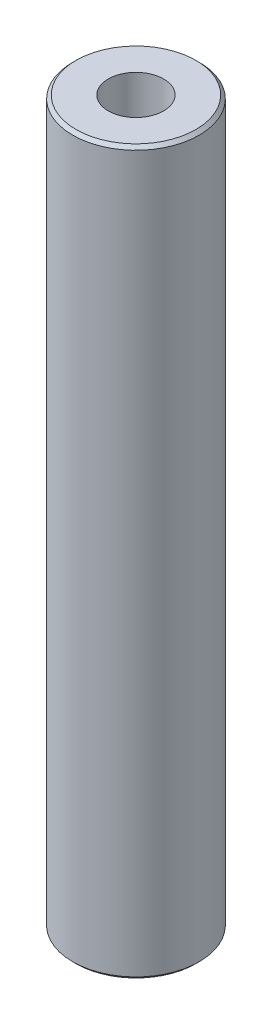
ISO-10303-21;
HEADER;
FILE_DESCRIPTION(('STEP AP214'),'2;1');
FILE_NAME('part.step','',(''),(''),'','','');
FILE_SCHEMA(('AUTOMOTIVE_DESIGN { 1 0 10303 214 1 1 1 1 }'));
ENDSEC;
DATA;
#1=APPLICATION_CONTEXT('core data for automotive mechanical design processes');
#2=APPLICATION_PROTOCOL_DEFINITION('international standard','automotive_design',2000,#1);
#3=PRODUCT_CONTEXT('',#1,'mechanical');
#4=PRODUCT('Part','Part','',(#3));
#5=PRODUCT_RELATED_PRODUCT_CATEGORY('part','',(#4));
#6=PRODUCT_DEFINITION_FORMATION('','',#4);
#7=PRODUCT_DEFINITION_CONTEXT('part definition',#1,'design');
#8=PRODUCT_DEFINITION('design','',#6,#7);
#9=PRODUCT_DEFINITION_SHAPE('','',#8);
#10=(LENGTH_UNIT() NAMED_UNIT(*) SI_UNIT(.MILLI.,.METRE.));
#11=(NAMED_UNIT(*) PLANE_ANGLE_UNIT() SI_UNIT($,.RADIAN.));
#12=(NAMED_UNIT(*) SI_UNIT($,.STERADIAN.) SOLID_ANGLE_UNIT());
#13=UNCERTAINTY_MEASURE_WITH_UNIT(LENGTH_MEASURE(1.E-05),#10,'distance_accuracy_value','');
#14=(GEOMETRIC_REPRESENTATION_CONTEXT(3) GLOBAL_UNCERTAINTY_ASSIGNED_CONTEXT((#13)) GLOBAL_UNIT_ASSIGNED_CONTEXT((#10,
#11,#12)) REPRESENTATION_CONTEXT('',''));
#15=CARTESIAN_POINT('',(0.,0.,0.));
#16=DIRECTION('',(0.,0.,1.));
#17=DIRECTION('',(1.,0.,0.));
#18=AXIS2_PLACEMENT_3D('',#15,#16,#17);
#19=CARTESIAN_POINT('',(0.,600.,0.));
#20=DIRECTION('',(0.,-1.,0.));
#21=DIRECTION('',(0.,0.,-1.));
#22=AXIS2_PLACEMENT_3D('',#19,#20,#21);
#23=CYLINDRICAL_SURFACE('',#22,52.5);
#24=CARTESIAN_POINT('',(0.,597.283966260408,0.));
#25=DIRECTION('',(0.,1.,0.));
#26=DIRECTION('',(0.,0.,1.));
#27=AXIS2_PLACEMENT_3D('',#24,#25,#26);
#28=CIRCLE('',#27,52.5);
#29=CARTESIAN_POINT('',(0.,597.283966260408,52.5));
#30=VERTEX_POINT('',#29);
#31=EDGE_CURVE('E50',#30,#30,#28,.F.);
#32=ORIENTED_EDGE('',*,*,#31,.T.);
#33=EDGE_LOOP('',(#32));
#34=FACE_BOUND('',#33,.T.);
#35=CARTESIAN_POINT('',(0.,2.71603373959195,0.));
#36=DIRECTION('',(0.,1.,0.));
#37=DIRECTION('',(0.,0.,1.));
#38=AXIS2_PLACEMENT_3D('',#35,#36,#37);
#39=CIRCLE('',#38,52.5);
#40=CARTESIAN_POINT('',(0.,2.71603373959195,52.5));
#41=VERTEX_POINT('',#40);
#42=EDGE_CURVE('E51',#41,#41,#39,.T.);
#43=ORIENTED_EDGE('',*,*,#42,.T.);
#44=EDGE_LOOP('',(#43));
#45=FACE_BOUND('',#44,.T.);
#46=ADVANCED_FACE('F39',(#34,#45),#23,.T.);
#47=CARTESIAN_POINT('',(0.,600.,0.));
#48=DIRECTION('',(0.,1.,0.));
#49=DIRECTION('',(0.,0.,1.));
#50=AXIS2_PLACEMENT_3D('',#47,#48,#49);
#51=PLANE('',#50);
#52=CARTESIAN_POINT('',(0.,600.,0.));
#53=DIRECTION('',(0.,1.,0.));
#54=DIRECTION('',(0.,0.,1.));
#55=AXIS2_PLACEMENT_3D('',#52,#53,#54);
#56=CIRCLE('',#55,49.7839662604079);
#57=CARTESIAN_POINT('',(0.,600.,49.7839662604079));
#58=VERTEX_POINT('',#57);
#59=EDGE_CURVE('E54',#58,#58,#56,.T.);
#60=ORIENTED_EDGE('',*,*,#59,.T.);
#61=EDGE_LOOP('',(#60));
#62=FACE_BOUND('',#61,.T.);
#63=CARTESIAN_POINT('',(0.,600.,0.));
#64=DIRECTION('',(0.,1.,0.));
#65=DIRECTION('',(0.,0.,1.));
#66=AXIS2_PLACEMENT_3D('',#63,#64,#65);
#67=CIRCLE('',#66,23.0073254854229);
#68=CARTESIAN_POINT('',(0.,600.,23.0073254854229));
#69=VERTEX_POINT('',#68);
#70=EDGE_CURVE('E58',#69,#69,#67,.T.);
#71=ORIENTED_EDGE('',*,*,#70,.F.);
#72=EDGE_LOOP('',(#71));
#73=FACE_BOUND('',#72,.T.);
#74=ADVANCED_FACE('F69',(#62,#73),#51,.T.);
#75=CARTESIAN_POINT('',(0.,0.,0.));
#76=DIRECTION('',(0.,1.,0.));
#77=DIRECTION('',(0.,0.,1.));
#78=AXIS2_PLACEMENT_3D('',#75,#76,#77);
#79=PLANE('',#78);
#80=CARTESIAN_POINT('',(0.,0.,0.));
#81=DIRECTION('',(0.,1.,0.));
#82=DIRECTION('',(0.,0.,1.));
#83=AXIS2_PLACEMENT_3D('',#80,#81,#82);
#84=CIRCLE('',#83,49.783966260408);
#85=CARTESIAN_POINT('',(0.,0.,49.783966260408));
#86=VERTEX_POINT('',#85);
#87=EDGE_CURVE('E10',#86,#86,#84,.F.);
#88=ORIENTED_EDGE('',*,*,#87,.T.);
#89=EDGE_LOOP('',(#88));
#90=FACE_BOUND('',#89,.T.);
#91=CARTESIAN_POINT('',(0.,0.,0.));
#92=DIRECTION('',(0.,1.,0.));
#93=DIRECTION('',(0.,0.,1.));
#94=AXIS2_PLACEMENT_3D('',#91,#92,#93);
#95=CIRCLE('',#94,23.0073254854229);
#96=CARTESIAN_POINT('',(0.,0.,23.0073254854229));
#97=VERTEX_POINT('',#96);
#98=EDGE_CURVE('E63',#97,#97,#95,.T.);
#99=ORIENTED_EDGE('',*,*,#98,.T.);
#100=EDGE_LOOP('',(#99));
#101=FACE_BOUND('',#100,.T.);
#102=ADVANCED_FACE('F75',(#90,#101),#79,.F.);
#103=CARTESIAN_POINT('',(0.,600.,0.));
#104=DIRECTION('',(0.,-1.,0.));
#105=DIRECTION('',(0.,0.,-1.));
#106=AXIS2_PLACEMENT_3D('',#103,#104,#105);
#107=CYLINDRICAL_SURFACE('',#106,23.0073254854229);
#108=ORIENTED_EDGE('',*,*,#70,.T.);
#109=EDGE_LOOP('',(#108));
#110=FACE_BOUND('',#109,.T.);
#111=ORIENTED_EDGE('',*,*,#98,.F.);
#112=EDGE_LOOP('',(#111));
#113=FACE_BOUND('',#112,.T.);
#114=ADVANCED_FACE('F70',(#110,#113),#107,.F.);
#115=CARTESIAN_POINT('',(0.,600.,0.));
#116=DIRECTION('',(0.,-1.,0.));
#117=DIRECTION('',(0.,0.,-1.));
#118=AXIS2_PLACEMENT_3D('',#115,#116,#117);
#119=CONICAL_SURFACE('',#118,49.7839662604079,0.78539816339745);
#120=ORIENTED_EDGE('',*,*,#31,.F.);
#121=EDGE_LOOP('',(#120));
#122=FACE_BOUND('',#121,.T.);
#123=ORIENTED_EDGE('',*,*,#59,.F.);
#124=EDGE_LOOP('',(#123));
#125=FACE_BOUND('',#124,.T.);
#126=ADVANCED_FACE('F81',(#122,#125),#119,.T.);
#127=CARTESIAN_POINT('',(0.,2.71603373959195,0.));
#128=DIRECTION('',(0.,1.,0.));
#129=DIRECTION('',(0.,0.,1.));
#130=AXIS2_PLACEMENT_3D('',#127,#128,#129);
#131=CONICAL_SURFACE('',#130,52.5,0.78539816339746);
#132=ORIENTED_EDGE('',*,*,#87,.F.);
#133=EDGE_LOOP('',(#132));
#134=FACE_BOUND('',#133,.T.);
#135=ORIENTED_EDGE('',*,*,#42,.F.);
#136=EDGE_LOOP('',(#135));
#137=FACE_BOUND('',#136,.T.);
#138=ADVANCED_FACE('F45',(#134,#137),#131,.T.);
#139=CLOSED_SHELL('',(#46,#74,#102,#114,#126,#138));
#140=MANIFOLD_SOLID_BREP('B2',#139);
#141=ADVANCED_BREP_SHAPE_REPRESENTATION('',(#18,#140),#14);
#142=SHAPE_DEFINITION_REPRESENTATION(#9,#141);
ENDSEC;
END-ISO-10303-21;
